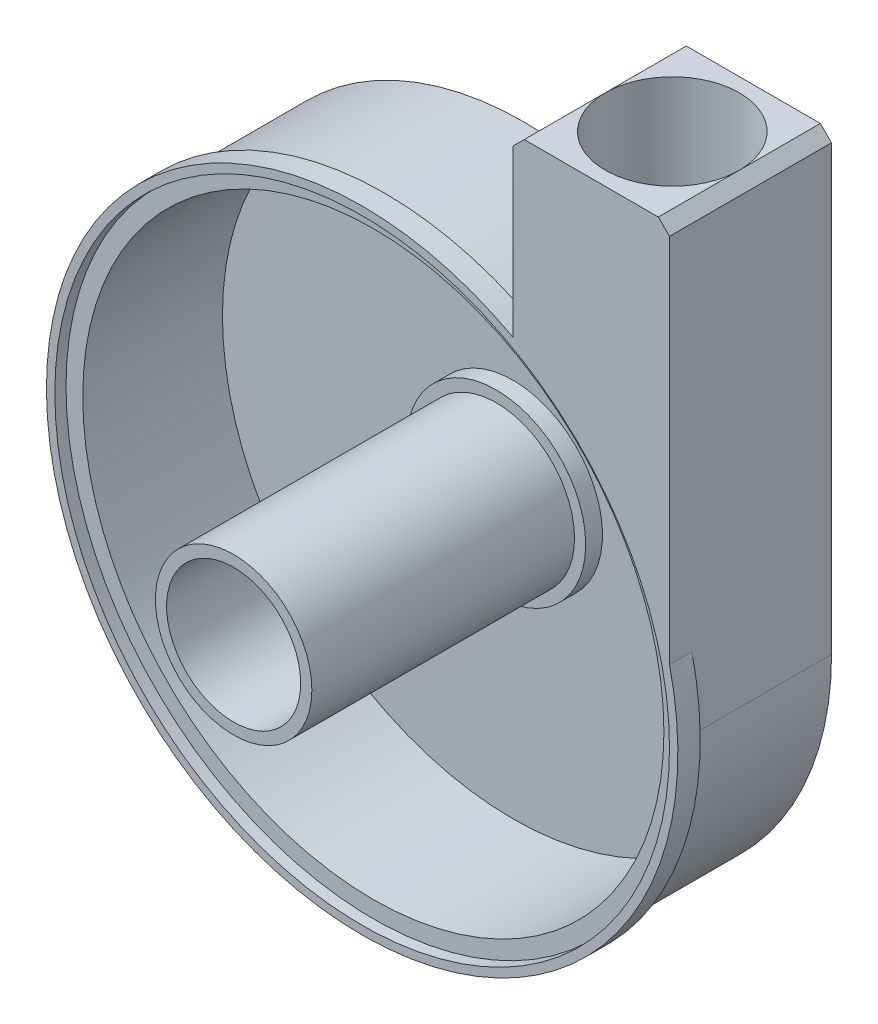
ISO-10303-21;
HEADER;
FILE_DESCRIPTION(('STEP AP214'),'2;1');
FILE_NAME('part.step','',(''),(''),'','','');
FILE_SCHEMA(('AUTOMOTIVE_DESIGN { 1 0 10303 214 1 1 1 1 }'));
ENDSEC;
DATA;
#1=APPLICATION_CONTEXT('core data for automotive mechanical design processes');
#2=APPLICATION_PROTOCOL_DEFINITION('international standard','automotive_design',2000,#1);
#3=PRODUCT_CONTEXT('',#1,'mechanical');
#4=PRODUCT('Part','Part','',(#3));
#5=PRODUCT_RELATED_PRODUCT_CATEGORY('part','',(#4));
#6=PRODUCT_DEFINITION_FORMATION('','',#4);
#7=PRODUCT_DEFINITION_CONTEXT('part definition',#1,'design');
#8=PRODUCT_DEFINITION('design','',#6,#7);
#9=PRODUCT_DEFINITION_SHAPE('','',#8);
#10=(LENGTH_UNIT() NAMED_UNIT(*) SI_UNIT(.MILLI.,.METRE.));
#11=(NAMED_UNIT(*) PLANE_ANGLE_UNIT() SI_UNIT($,.RADIAN.));
#12=(NAMED_UNIT(*) SI_UNIT($,.STERADIAN.) SOLID_ANGLE_UNIT());
#13=UNCERTAINTY_MEASURE_WITH_UNIT(LENGTH_MEASURE(1.E-05),#10,'distance_accuracy_value','');
#14=(GEOMETRIC_REPRESENTATION_CONTEXT(3) GLOBAL_UNCERTAINTY_ASSIGNED_CONTEXT((#13)) GLOBAL_UNIT_ASSIGNED_CONTEXT((#10,
#11,#12)) REPRESENTATION_CONTEXT('',''));
#15=CARTESIAN_POINT('',(0.,0.,0.));
#16=DIRECTION('',(0.,0.,1.));
#17=DIRECTION('',(1.,0.,0.));
#18=AXIS2_PLACEMENT_3D('',#15,#16,#17);
#19=CARTESIAN_POINT('',(0.,0.,25.));
#20=DIRECTION('',(0.,0.,-1.));
#21=DIRECTION('',(-1.,0.,0.));
#22=AXIS2_PLACEMENT_3D('',#19,#20,#21);
#23=CYLINDRICAL_SURFACE('',#22,55.);
#24=CARTESIAN_POINT('',(0.,0.,23.));
#25=DIRECTION('',(0.,0.,1.));
#26=DIRECTION('',(1.,0.,0.));
#27=AXIS2_PLACEMENT_3D('',#24,#25,#26);
#28=CIRCLE('',#27,55.);
#29=CARTESIAN_POINT('',(27.,47.9165942028438,23.));
#30=VERTEX_POINT('',#29);
#31=CARTESIAN_POINT('',(55.,0.,23.));
#32=VERTEX_POINT('',#31);
#33=EDGE_CURVE('E151',#30,#32,#28,.T.);
#34=ORIENTED_EDGE('',*,*,#33,.F.);
#35=DIRECTION('',(0.,0.,-1.));
#36=VECTOR('',#35,1.);
#37=CARTESIAN_POINT('',(27.,47.9165942028438,25.));
#38=LINE('',#37,#36);
#39=CARTESIAN_POINT('',(27.,47.9165942028438,-2.));
#40=VERTEX_POINT('',#39);
#41=EDGE_CURVE('E289',#30,#40,#38,.T.);
#42=ORIENTED_EDGE('',*,*,#41,.T.);
#43=CARTESIAN_POINT('',(0.,0.,-2.));
#44=DIRECTION('',(0.,0.,-1.));
#45=DIRECTION('',(-1.,0.,0.));
#46=AXIS2_PLACEMENT_3D('',#43,#44,#45);
#47=CIRCLE('',#46,55.);
#48=CARTESIAN_POINT('',(55.,0.,-2.));
#49=VERTEX_POINT('',#48);
#50=EDGE_CURVE('E246',#49,#40,#47,.T.);
#51=ORIENTED_EDGE('',*,*,#50,.F.);
#52=DIRECTION('',(0.,0.,-1.));
#53=VECTOR('',#52,1.);
#54=CARTESIAN_POINT('',(55.,0.,25.));
#55=LINE('',#54,#53);
#56=EDGE_CURVE('E292',#32,#49,#55,.T.);
#57=ORIENTED_EDGE('',*,*,#56,.F.);
#58=EDGE_LOOP('',(#34,#42,#51,#57));
#59=FACE_BOUND('',#58,.T.);
#60=ADVANCED_FACE('F41',(#59),#23,.T.);
#61=CARTESIAN_POINT('',(55.,0.,-2.));
#62=DIRECTION('',(1.,0.,0.));
#63=DIRECTION('',(0.,0.,-1.));
#64=AXIS2_PLACEMENT_3D('',#61,#62,#63);
#65=PLANE('',#64);
#66=DIRECTION('',(0.,0.,-1.));
#67=VECTOR('',#66,1.);
#68=CARTESIAN_POINT('',(55.,12.9325171563776,27.));
#69=LINE('',#68,#67);
#70=CARTESIAN_POINT('',(55.,12.9325171563775,27.));
#71=VERTEX_POINT('',#70);
#72=CARTESIAN_POINT('',(55.,12.9325171563776,23.));
#73=VERTEX_POINT('',#72);
#74=EDGE_CURVE('E63',#71,#73,#69,.T.);
#75=ORIENTED_EDGE('',*,*,#74,.T.);
#76=DIRECTION('',(0.,-1.,0.));
#77=VECTOR('',#76,1.);
#78=CARTESIAN_POINT('',(55.,0.,23.));
#79=LINE('',#78,#77);
#80=EDGE_CURVE('E67',#73,#32,#79,.T.);
#81=ORIENTED_EDGE('',*,*,#80,.T.);
#82=ORIENTED_EDGE('',*,*,#56,.T.);
#83=DIRECTION('',(0.,1.,0.));
#84=VECTOR('',#83,1.);
#85=CARTESIAN_POINT('',(55.,0.,-2.));
#86=LINE('',#85,#84);
#87=CARTESIAN_POINT('',(55.,79.287132565223,-2.));
#88=VERTEX_POINT('',#87);
#89=EDGE_CURVE('E251',#49,#88,#86,.T.);
#90=ORIENTED_EDGE('',*,*,#89,.T.);
#91=DIRECTION('',(0.,0.,1.));
#92=VECTOR('',#91,1.);
#93=CARTESIAN_POINT('',(55.,79.287132565223,-2.));
#94=LINE('',#93,#92);
#95=CARTESIAN_POINT('',(55.,79.287132565223,27.));
#96=VERTEX_POINT('',#95);
#97=EDGE_CURVE('E143',#88,#96,#94,.T.);
#98=ORIENTED_EDGE('',*,*,#97,.T.);
#99=DIRECTION('',(0.,1.,0.));
#100=VECTOR('',#99,1.);
#101=CARTESIAN_POINT('',(55.,0.,27.));
#102=LINE('',#101,#100);
#103=EDGE_CURVE('E250',#71,#96,#102,.T.);
#104=ORIENTED_EDGE('',*,*,#103,.F.);
#105=EDGE_LOOP('',(#75,#81,#82,#90,#98,#104));
#106=FACE_BOUND('',#105,.T.);
#107=ADVANCED_FACE('F193',(#106),#65,.T.);
#108=CARTESIAN_POINT('',(27.,0.,-2.));
#109=DIRECTION('',(-1.,0.,0.));
#110=DIRECTION('',(0.,0.,1.));
#111=AXIS2_PLACEMENT_3D('',#108,#109,#110);
#112=PLANE('',#111);
#113=ORIENTED_EDGE('',*,*,#41,.F.);
#114=DIRECTION('',(0.,1.,0.));
#115=VECTOR('',#114,1.);
#116=CARTESIAN_POINT('',(27.,0.,23.));
#117=LINE('',#116,#115);
#118=CARTESIAN_POINT('',(27.,49.6311394187157,23.));
#119=VERTEX_POINT('',#118);
#120=EDGE_CURVE('E384',#30,#119,#117,.T.);
#121=ORIENTED_EDGE('',*,*,#120,.T.);
#122=DIRECTION('',(0.,0.,-1.));
#123=VECTOR('',#122,1.);
#124=CARTESIAN_POINT('',(27.,49.6311394187157,27.));
#125=LINE('',#124,#123);
#126=CARTESIAN_POINT('',(27.,49.6311394187157,27.));
#127=VERTEX_POINT('',#126);
#128=EDGE_CURVE('E368',#119,#127,#125,.F.);
#129=ORIENTED_EDGE('',*,*,#128,.T.);
#130=DIRECTION('',(0.,-1.,0.));
#131=VECTOR('',#130,1.);
#132=CARTESIAN_POINT('',(27.,0.,27.));
#133=LINE('',#132,#131);
#134=CARTESIAN_POINT('',(27.,79.287132565223,27.));
#135=VERTEX_POINT('',#134);
#136=EDGE_CURVE('E271',#135,#127,#133,.T.);
#137=ORIENTED_EDGE('',*,*,#136,.F.);
#138=DIRECTION('',(0.,0.,-1.));
#139=VECTOR('',#138,1.);
#140=CARTESIAN_POINT('',(27.,79.287132565223,-2.));
#141=LINE('',#140,#139);
#142=CARTESIAN_POINT('',(27.,79.287132565223,-2.));
#143=VERTEX_POINT('',#142);
#144=EDGE_CURVE('E322',#135,#143,#141,.T.);
#145=ORIENTED_EDGE('',*,*,#144,.T.);
#146=DIRECTION('',(0.,-1.,0.));
#147=VECTOR('',#146,1.);
#148=CARTESIAN_POINT('',(27.,0.,-2.));
#149=LINE('',#148,#147);
#150=EDGE_CURVE('E260',#143,#40,#149,.T.);
#151=ORIENTED_EDGE('',*,*,#150,.T.);
#152=EDGE_LOOP('',(#113,#121,#129,#137,#145,#151));
#153=FACE_BOUND('',#152,.T.);
#154=ADVANCED_FACE('F199',(#153),#112,.T.);
#155=CARTESIAN_POINT('',(41.,1.28713256522298,12.5));
#156=DIRECTION('',(0.,1.,0.));
#157=DIRECTION('',(0.,0.,1.));
#158=AXIS2_PLACEMENT_3D('',#155,#156,#157);
#159=CYLINDRICAL_SURFACE('',#158,12.);
#160=CARTESIAN_POINT('',(41.,81.287132565223,12.5));
#161=DIRECTION('',(0.,1.,0.));
#162=DIRECTION('',(0.,0.,1.));
#163=AXIS2_PLACEMENT_3D('',#160,#161,#162);
#164=CIRCLE('',#163,12.);
#165=CARTESIAN_POINT('',(53.,81.287132565223,12.5));
#166=VERTEX_POINT('',#165);
#167=CARTESIAN_POINT('',(29.,81.287132565223,12.5));
#168=VERTEX_POINT('',#167);
#169=EDGE_CURVE('E225',#166,#168,#164,.T.);
#170=ORIENTED_EDGE('',*,*,#169,.T.);
#171=EDGE_CURVE('E352',#168,#166,#164,.T.);
#172=ORIENTED_EDGE('',*,*,#171,.T.);
#173=EDGE_LOOP('',(#170,#172));
#174=FACE_BOUND('',#173,.T.);
#175=CARTESIAN_POINT('',(51.9840676530756,1.28713256522298,17.3322104458165));
#176=CARTESIAN_POINT('',(51.9745694362723,1.67110930174672,17.3537119873882));
#177=CARTESIAN_POINT('',(51.9608151287572,2.05433764750318,17.3848977053577));
#178=CARTESIAN_POINT('',(51.9249724935482,2.81835467896894,17.4645845076469));
#179=CARTESIAN_POINT('',(51.9028897243842,3.19914481996402,17.5130740420023));
#180=CARTESIAN_POINT('',(51.8506464669257,3.95653326228744,17.6251537999123));
#181=CARTESIAN_POINT('',(51.8205144132512,4.33314155030208,17.6886907794489));
#182=CARTESIAN_POINT('',(51.7523140485848,5.08329112968576,17.8285841618358));
#183=CARTESIAN_POINT('',(51.7142443029309,5.45683185391914,17.9049428816067));
#184=CARTESIAN_POINT('',(51.6302235136286,6.20168317940109,18.0683744650405));
#185=CARTESIAN_POINT('',(51.5842521441956,6.57298540730616,18.1554747925049));
#186=CARTESIAN_POINT('',(51.4846334750242,7.31243202309994,18.338091180765));
#187=CARTESIAN_POINT('',(51.4309866065403,7.68057658717377,18.4336067686261));
#188=CARTESIAN_POINT('',(51.258549628427,8.78143244711176,18.7301082909783));
#189=CARTESIAN_POINT('',(51.1283562135597,9.50974566418177,18.9408601325688));
#190=CARTESIAN_POINT('',(50.8350356067977,10.9711469744673,19.3806646733147));
#191=CARTESIAN_POINT('',(50.671279176739,11.7040187841901,19.6100070385101));
#192=CARTESIAN_POINT('',(50.3126296030789,13.160618103055,20.0736984698944));
#193=CARTESIAN_POINT('',(50.1177319900366,13.8843442834858,20.3080482505683));
#194=CARTESIAN_POINT('',(49.6965462062547,15.3237002972135,20.7745974405658));
#195=CARTESIAN_POINT('',(49.4702438663132,16.0393263173573,21.0067958284924));
#196=CARTESIAN_POINT('',(48.9859965672613,17.4624455715886,21.4629537643854));
#197=CARTESIAN_POINT('',(48.7280528880916,18.1699391333809,21.6869136451359));
#198=CARTESIAN_POINT('',(48.1810434403361,19.5742929508029,22.1205010589176));
#199=CARTESIAN_POINT('',(47.8920862101765,20.2711811352199,22.3301746322135));
#200=CARTESIAN_POINT('',(47.2819013814071,21.6562810573743,22.7308834392291));
#201=CARTESIAN_POINT('',(46.9606705395514,22.3444919152711,22.9219167959425));
#202=CARTESIAN_POINT('',(46.2860583091104,23.7103401868625,23.2797597972987));
#203=CARTESIAN_POINT('',(45.9327169931327,24.3879895758711,23.4465989779784));
#204=CARTESIAN_POINT('',(45.193510841899,25.7319725222956,23.7505171752589));
#205=CARTESIAN_POINT('',(44.8076564821327,26.3983096419459,23.8876057268042));
#206=CARTESIAN_POINT('',(44.0861203372295,27.5824420196436,24.1011580168158));
#207=CARTESIAN_POINT('',(43.7563894298821,28.1026616172599,24.1842895376967));
#208=CARTESIAN_POINT('',(43.0769070475607,29.1335037232319,24.323990815637));
#209=CARTESIAN_POINT('',(42.727157810391,29.6441272958616,24.3805635351645));
#210=CARTESIAN_POINT('',(42.0077324536583,30.6551129392115,24.463101779875));
#211=CARTESIAN_POINT('',(41.6380226238782,31.155455546945,24.4890137186237));
#212=CARTESIAN_POINT('',(40.8805112396724,32.1429770482467,24.5053840158863));
#213=CARTESIAN_POINT('',(40.4927094695928,32.6301557847937,24.4958419516859));
#214=CARTESIAN_POINT('',(39.6959357874045,33.5950753084102,24.4357066912785));
#215=CARTESIAN_POINT('',(39.2867551156926,34.0726128821382,24.3845847961161));
#216=CARTESIAN_POINT('',(38.4550479032361,35.0085861759452,24.2346395446702));
#217=CARTESIAN_POINT('',(38.0325187958329,35.4670181825883,24.1358069616823));
#218=CARTESIAN_POINT('',(37.1803746320696,36.3593047535247,23.8845141990669));
#219=CARTESIAN_POINT('',(36.7507876229339,36.7932355668633,23.7322324088935));
#220=CARTESIAN_POINT('',(35.8900273320619,37.6333188602382,23.3676693054707));
#221=CARTESIAN_POINT('',(35.4588555725789,38.0394930262137,23.1554355132812));
#222=CARTESIAN_POINT('',(34.777624459092,38.6605148945844,22.7648781818436));
#223=CARTESIAN_POINT('',(34.5250816993346,38.8861090077131,22.6077508630353));
#224=CARTESIAN_POINT('',(34.0250418051374,39.3243798518123,22.2693923494689));
#225=CARTESIAN_POINT('',(33.7775430949317,39.5370606593171,22.0881688197543));
#226=CARTESIAN_POINT('',(33.2902082385774,39.9482633390739,21.7008692014771));
#227=CARTESIAN_POINT('',(33.0503731905696,40.146783187153,21.4947895712578));
#228=CARTESIAN_POINT('',(32.5814220684351,40.5282901074064,21.0574716380064));
#229=CARTESIAN_POINT('',(32.3523063950423,40.7112765990884,20.8262323954787));
#230=CARTESIAN_POINT('',(31.9060058800817,41.0620033343906,20.3364569261454));
#231=CARTESIAN_POINT('',(31.6889549199548,41.2295823841218,20.0776824430867));
#232=CARTESIAN_POINT('',(31.2727570831849,41.5461557378602,19.5354483011476));
#233=CARTESIAN_POINT('',(31.073610688046,41.6951495420998,19.251987978799));
#234=CARTESIAN_POINT('',(30.6970270713713,41.973173679815,18.6620703843875));
#235=CARTESIAN_POINT('',(30.5195750477024,42.1022176412103,18.35562902529));
#236=CARTESIAN_POINT('',(30.1898093904112,42.3393043794996,17.7218115195374));
#237=CARTESIAN_POINT('',(30.037490886441,42.447351225916,17.3944394459143));
#238=CARTESIAN_POINT('',(29.7806511487351,42.6278533970847,16.7689531854471));
#239=CARTESIAN_POINT('',(29.6724219194563,42.7031757107383,16.473181731895));
#240=CARTESIAN_POINT('',(29.4787494608739,42.8371009098809,15.8705932317058));
#241=CARTESIAN_POINT('',(29.3933041251962,42.8957053409755,15.5637772091193));
#242=CARTESIAN_POINT('',(29.24672411282,42.9957790345472,14.9418307770493));
#243=CARTESIAN_POINT('',(29.1855764806886,43.037257429017,14.6267048941917));
#244=CARTESIAN_POINT('',(29.0886221287975,43.1028480761907,13.9908009292574));
#245=CARTESIAN_POINT('',(29.0528133320548,43.1269617522551,13.6700233126537));
#246=CARTESIAN_POINT('',(29.0096992662453,43.1559719483977,13.0614389968831));
#247=CARTESIAN_POINT('',(28.9996809194966,43.1626979836285,12.7739070247221));
#248=CARTESIAN_POINT('',(29.0003344928752,43.162259080735,12.1988937628445));
#249=CARTESIAN_POINT('',(29.0110044897182,43.15509543386,11.9114124709011));
#250=CARTESIAN_POINT('',(29.0528733303176,43.1269194504915,11.3387146800553));
#251=CARTESIAN_POINT('',(29.0840667359642,43.105910782526,11.0534976014575));
#252=CARTESIAN_POINT('',(29.1665290557954,43.0501574304146,10.487340685991));
#253=CARTESIAN_POINT('',(29.2177981754666,43.0154126056713,10.2064008929334));
#254=CARTESIAN_POINT('',(29.3383142891486,42.9333028960607,9.65704601685333));
#255=CARTESIAN_POINT('',(29.4071316559976,42.8862389717612,9.38849134928419));
#256=CARTESIAN_POINT('',(29.5623404178681,42.7793980324254,8.85911770797881));
#257=CARTESIAN_POINT('',(29.6487313283606,42.7196213678964,8.59829852119085));
#258=CARTESIAN_POINT('',(29.8379797252684,42.5876538671114,8.08594409794056));
#259=CARTESIAN_POINT('',(29.9408376859299,42.5154626733163,7.83440912911772));
#260=CARTESIAN_POINT('',(30.1617453172764,42.3590300576804,7.34199026473146));
#261=CARTESIAN_POINT('',(30.2797955206138,42.2747882133224,7.10110674301436));
#262=CARTESIAN_POINT('',(30.5355905849295,42.0904230083639,6.62005060334006));
#263=CARTESIAN_POINT('',(30.6740019723469,41.9897377772978,6.38044801330008));
#264=CARTESIAN_POINT('',(30.9642532601789,41.776159173028,5.9152475970459));
#265=CARTESIAN_POINT('',(31.1160934604224,41.6632655272313,5.68965008371826));
#266=CARTESIAN_POINT('',(31.4314865700803,41.4258446637232,5.25320378581339));
#267=CARTESIAN_POINT('',(31.5950414840092,41.3013154539254,5.04235753759732));
#268=CARTESIAN_POINT('',(31.9321188625636,41.0412610075159,4.63595211361611));
#269=CARTESIAN_POINT('',(32.1056426093364,40.905734355533,4.44039491193123));
#270=CARTESIAN_POINT('',(32.481722253498,40.6079025024139,4.04291509639092));
#271=CARTESIAN_POINT('',(32.6853013746002,40.4443186571349,3.84291847677442));
#272=CARTESIAN_POINT('',(33.1005295307535,40.1051968727267,3.46242920752293));
#273=CARTESIAN_POINT('',(33.3121789645621,39.9296583425736,3.28193752332879));
#274=CARTESIAN_POINT('',(33.7415498097628,39.5674954270473,2.94017717249196));
#275=CARTESIAN_POINT('',(33.959273061053,39.3808676627147,2.77891441049507));
#276=CARTESIAN_POINT('',(34.3988833727023,38.9974612874152,2.47519730544743));
#277=CARTESIAN_POINT('',(34.6207712399729,38.8006806961051,2.33274665119673));
#278=CARTESIAN_POINT('',(35.1886685806181,38.2880258451458,1.99334976986854));
#279=CARTESIAN_POINT('',(35.5364295098228,37.9656850348828,1.80900508218152));
#280=CARTESIAN_POINT('',(36.2327335293313,37.3017530570086,1.48085960697622));
#281=CARTESIAN_POINT('',(36.5812768905149,36.960153716369,1.33707619083614));
#282=CARTESIAN_POINT('',(37.2757269566632,36.2596727212093,1.08657303683363));
#283=CARTESIAN_POINT('',(37.6216267619205,35.900756957167,0.979930159660575));
#284=CARTESIAN_POINT('',(38.306899596174,35.1686378980617,0.800741516364733));
#285=CARTESIAN_POINT('',(38.6462726266834,34.7954346063114,0.728195742336321));
#286=CARTESIAN_POINT('',(39.4773170170129,33.8541357709139,0.586361130990221));
#287=CARTESIAN_POINT('',(39.9637532684799,33.2786162255362,0.535411785151946));
#288=CARTESIAN_POINT('',(40.912124078594,32.1055750149096,0.490928745097687));
#289=CARTESIAN_POINT('',(41.3740465614912,31.5080427470373,0.497423088943499));
#290=CARTESIAN_POINT('',(42.270598436407,30.294654311332,0.558994411464451));
#291=CARTESIAN_POINT('',(42.7052038953758,29.6787827533987,0.614113372784211));
#292=CARTESIAN_POINT('',(43.5449901838663,28.4323523351908,0.765220881085495));
#293=CARTESIAN_POINT('',(43.9501720840304,27.8017940104311,0.861207940116096));
#294=CARTESIAN_POINT('',(44.6572216467141,26.6477174168124,1.06612073493955));
#295=CARTESIAN_POINT('',(44.9642217774066,26.1262819616131,1.16925168880449));
#296=CARTESIAN_POINT('',(45.5581979866705,25.0761742300501,1.39487611131003));
#297=CARTESIAN_POINT('',(45.8451714332686,24.547501013356,1.51737211808825));
#298=CARTESIAN_POINT('',(46.3991499005108,23.4835845639411,1.77885216410611));
#299=CARTESIAN_POINT('',(46.6661478004427,22.9483390667942,1.91784203770852));
#300=CARTESIAN_POINT('',(47.1801897667621,21.8720237745661,2.20958537879276));
#301=CARTESIAN_POINT('',(47.4272312442413,21.3309532340984,2.36234062660961));
#302=CARTESIAN_POINT('',(48.1396252067601,19.6974624425611,2.83811017273712));
#303=CARTESIAN_POINT('',(48.5751894289141,18.5967999640165,3.17810902095779));
#304=CARTESIAN_POINT('',(49.1699373155457,16.9311823264762,3.70667375873392));
#305=CARTESIAN_POINT('',(49.3584490537078,16.3734367204529,3.88599059696032));
#306=CARTESIAN_POINT('',(49.7161549799081,15.2528630249043,4.24812973127111));
#307=CARTESIAN_POINT('',(49.8853491983607,14.6900349433824,4.43095202183581));
#308=CARTESIAN_POINT('',(50.1899245284262,13.6108922240388,4.78028703506113));
#309=CARTESIAN_POINT('',(50.3269831243474,13.0950361547734,4.94676071725658));
#310=CARTESIAN_POINT('',(50.5853110901754,12.0586688677977,5.27741011643913));
#311=CARTESIAN_POINT('',(50.7065810913529,11.5381578370952,5.44158592506703));
#312=CARTESIAN_POINT('',(50.9331737617893,10.4927348802008,5.76421132804177));
#313=CARTESIAN_POINT('',(51.0385185065306,9.96783013055009,5.92266861288596));
#314=CARTESIAN_POINT('',(51.233388794606,8.91223811625418,6.23016148706712));
#315=CARTESIAN_POINT('',(51.3229119673848,8.38154999770837,6.37919566238941));
#316=CARTESIAN_POINT('',(51.4857110571973,7.31517047978924,6.66249308607005));
#317=CARTESIAN_POINT('',(51.5590270237624,6.77949490101472,6.79679232221448));
#318=CARTESIAN_POINT('',(51.6893187327968,5.70165482986253,7.04490123541474));
#319=CARTESIAN_POINT('',(51.7463022895639,5.15949357036743,7.15872070135187));
#320=CARTESIAN_POINT('',(51.8437296495413,4.0657591629753,7.35936524885506));
#321=CARTESIAN_POINT('',(51.8840905939043,3.51415280761044,7.44605459208245));
#322=CARTESIAN_POINT('',(51.931519401488,2.68228407823274,7.54991585865316));
#323=CARTESIAN_POINT('',(51.9451498512646,2.40400136179442,7.580189427998));
#324=CARTESIAN_POINT('',(51.9679618670431,1.84631780843159,7.63126957422093));
#325=CARTESIAN_POINT('',(51.9771422797442,1.56691670055392,7.65207369685006));
#326=CARTESIAN_POINT('',(51.9840676530756,1.28713256522295,7.66778955418346));
#327=B_SPLINE_CURVE_WITH_KNOTS('',3,(#175,#176,#177,#178,#179,#180,#181,#182,#183,#184,#185,
#186,#187,#188,#189,#190,#191,#192,#193,#194,#195,#196,#197,#198,#199,#200,#201,#202,#203,#204,
#205,#206,#207,#208,#209,#210,#211,#212,#213,#214,#215,#216,#217,#218,#219,#220,#221,#222,#223,
#224,#225,#226,#227,#228,#229,#230,#231,#232,#233,#234,#235,#236,#237,#238,#239,#240,#241,#242,
#243,#244,#245,#246,#247,#248,#249,#250,#251,#252,#253,#254,#255,#256,#257,#258,#259,#260,#261,
#262,#263,#264,#265,#266,#267,#268,#269,#270,#271,#272,#273,#274,#275,#276,#277,#278,#279,#280,
#281,#282,#283,#284,#285,#286,#287,#288,#289,#290,#291,#292,#293,#294,#295,#296,#297,#298,#299,
#300,#301,#302,#303,#304,#305,#306,#307,#308,#309,#310,#311,#312,#313,#314,#315,#316,#317,#318,
#319,#320,#321,#322,#323,#324,#325,#326),.UNSPECIFIED.,.F.,.F.,(4,2,2,2,2,2,2,2,2,2,2,2,2,2,2,2,
2,2,2,2,2,2,2,2,2,2,2,2,2,2,2,2,2,2,2,2,2,2,2,2,2,2,2,2,2,2,2,2,2,2,2,2,2,2,2,2,2,2,2,2,2,2,2,2,
2,2,2,2,2,2,2,2,2,2,2,4),(0.,1.15379575700456,2.30682281364456,3.45582939023745,
4.60504381908351,5.75725993122157,6.90941133050631,9.21625094652474,11.5711183075296,
13.9263239475979,16.2825956865218,18.6387721420637,20.9869561255545,23.3353763196785,
25.6809050022991,28.0256808395761,29.8893280710699,31.7527673749615,33.6194586596002,
35.4861722006714,37.3769996161224,39.2681928426696,41.1531332124871,43.036583653422,
44.1556252168191,45.2743116591261,46.3931576877737,47.5120455100698,48.6415532043629,
49.7710912652076,50.8998542860298,52.0283983187804,52.9985428638346,53.9685976877765,
54.9381345863033,55.9075920042631,56.7698927240105,57.6321132841334,58.494105472701,
59.3561064844892,60.1987477477379,61.0413657812477,61.8840080862704,62.7266799430605,
63.6091195619275,64.4915788882344,65.3741895752944,66.2569140350928,67.2427774373099,
68.2286896147354,69.2149037618566,70.201311006007,71.7252144667741,73.249769589868,
74.7774612216414,76.3051524992101,78.5674257041853,80.8308031776213,83.0961367728614,
85.3613878974899,87.2021713725238,89.0431963155952,90.8848744351241,92.7267910896032,
96.4176654238183,98.2637718556041,100.109875380743,101.786981658519,103.464020860449,
105.138713614317,106.813657076025,108.484414142514,110.154370489978,111.832553168194,
112.673143762404,113.513952093257),.UNSPECIFIED.);
#328=CARTESIAN_POINT('',(51.9840676530756,1.28713256522298,17.3322104458165));
#329=VERTEX_POINT('',#328);
#330=CARTESIAN_POINT('',(51.9840676530756,1.28713256522298,7.66778955418354));
#331=VERTEX_POINT('',#330);
#332=EDGE_CURVE('E214',#329,#331,#327,.T.);
#333=ORIENTED_EDGE('',*,*,#332,.T.);
#334=CARTESIAN_POINT('',(41.,1.28713256522298,12.5));
#335=DIRECTION('',(0.,1.,0.));
#336=DIRECTION('',(0.,0.,1.));
#337=AXIS2_PLACEMENT_3D('',#334,#335,#336);
#338=CIRCLE('',#337,12.);
#339=EDGE_CURVE('E224',#329,#331,#338,.T.);
#340=ORIENTED_EDGE('',*,*,#339,.F.);
#341=EDGE_LOOP('',(#333,#340));
#342=FACE_BOUND('',#341,.T.);
#343=CARTESIAN_POINT('',(35.1905249806889,44.2026803665062,23.));
#344=CARTESIAN_POINT('',(35.3749365302978,44.0558718777332,23.1020291789073));
#345=CARTESIAN_POINT('',(35.560336704442,43.9063806029458,23.1982653801743));
#346=CARTESIAN_POINT('',(35.9324438034901,43.6023751605868,23.3794624553174));
#347=CARTESIAN_POINT('',(36.1191504018676,43.447862215248,23.4644260476422));
#348=CARTESIAN_POINT('',(36.6796378512589,42.9778011308828,23.7026366890299));
#349=CARTESIAN_POINT('',(37.0545020537072,42.6551624282525,23.8395942502742));
#350=CARTESIAN_POINT('',(37.7992236788738,41.9965933639329,24.0717735358047));
#351=CARTESIAN_POINT('',(38.169096501691,41.6608002899795,24.1673422117704));
#352=CARTESIAN_POINT('',(38.9039845558947,40.9753913968028,24.321494920532));
#353=CARTESIAN_POINT('',(39.2689969580493,40.6257679600328,24.3800582612929));
#354=CARTESIAN_POINT('',(40.1102279563304,39.7978991699142,24.4767199443748));
#355=CARTESIAN_POINT('',(40.5835440928577,39.3151650610222,24.501755504056));
#356=CARTESIAN_POINT('',(41.512383448029,38.333136153184,24.4980527859937));
#357=CARTESIAN_POINT('',(41.9679018297845,37.8338369195816,24.469299992567));
#358=CARTESIAN_POINT('',(42.8600563247876,36.8201483930502,24.3635063026948));
#359=CARTESIAN_POINT('',(43.2966086272819,36.3057062407722,24.2862705965261));
#360=CARTESIAN_POINT('',(44.1469087686127,35.2668532037017,24.0882479733671));
#361=CARTESIAN_POINT('',(44.5606638287769,34.7424455472296,23.9674749399));
#362=CARTESIAN_POINT('',(45.2869253161634,33.7880370757974,23.7134002404121));
#363=CARTESIAN_POINT('',(45.603573602611,33.3593256746008,23.5870022748337));
#364=CARTESIAN_POINT('',(46.0657403760265,32.7149340604739,23.3796393770751));
#365=CARTESIAN_POINT('',(46.2172312138324,32.5005537847174,23.3077965024308));
#366=CARTESIAN_POINT('',(46.5162994514096,32.0710521296757,23.1582538900542));
#367=CARTESIAN_POINT('',(46.6638762269741,31.8559306382907,23.0805532256357));
#368=CARTESIAN_POINT('',(46.8094750193111,31.6405285735951,23.));
#369=B_SPLINE_CURVE_WITH_KNOTS('',3,(#343,#344,#345,#346,#347,#348,#349,#350,#351,#352,#353,
#354,#355,#356,#357,#358,#359,#360,#361,#362,#363,#364,#365,#366,#367,#368),.UNSPECIFIED.,.F.,
.F.,(4,2,2,2,2,2,2,2,2,2,2,2,4),(0.,0.770358008527263,1.54052990220082,3.07790411375054,
4.6021290062652,6.12720543734787,8.15379529460039,10.1809321397829,12.2162668468387,
14.2509530837654,15.8933922966776,16.7097840684417,17.5263052632674),.UNSPECIFIED.);
#370=CARTESIAN_POINT('',(35.1905249806889,44.2026803665062,23.));
#371=VERTEX_POINT('',#370);
#372=CARTESIAN_POINT('',(46.8094750193111,31.6405285735951,23.));
#373=VERTEX_POINT('',#372);
#374=EDGE_CURVE('E11',#371,#373,#369,.T.);
#375=ORIENTED_EDGE('',*,*,#374,.F.);
#376=DIRECTION('',(0.,1.,0.));
#377=VECTOR('',#376,1.);
#378=CARTESIAN_POINT('',(35.1905249806889,1.28713256522298,23.));
#379=LINE('',#378,#377);
#380=CARTESIAN_POINT('',(35.1905249806889,42.2685101651751,23.));
#381=VERTEX_POINT('',#380);
#382=EDGE_CURVE('E142',#381,#371,#379,.T.);
#383=ORIENTED_EDGE('',*,*,#382,.F.);
#384=CARTESIAN_POINT('',(35.1905249806889,42.2685101651751,23.));
#385=CARTESIAN_POINT('',(35.3720320263226,42.1174019269261,23.1004218196734));
#386=CARTESIAN_POINT('',(35.5543698933934,41.9636119301321,23.1951624637413));
#387=CARTESIAN_POINT('',(35.9200577429607,41.6510171373508,23.3736188280755));
#388=CARTESIAN_POINT('',(36.1034074703682,41.4922135615407,23.4573372056238));
#389=CARTESIAN_POINT('',(36.6534310282093,41.0093100174098,23.6922335785994));
#390=CARTESIAN_POINT('',(37.0207776896055,40.6781371936885,23.8275338531066));
#391=CARTESIAN_POINT('',(37.7495092678355,40.0027416109122,24.0576416904364));
#392=CARTESIAN_POINT('',(38.1109181296667,39.6586617768138,24.1528000228898));
#393=CARTESIAN_POINT('',(38.8281855497492,38.9566950260194,24.3075351946004));
#394=CARTESIAN_POINT('',(39.1840408420561,38.5988003851725,24.3670918121911));
#395=CARTESIAN_POINT('',(40.0246951317181,37.7295347079705,24.470440739148));
#396=CARTESIAN_POINT('',(40.5057221862062,37.2126881877978,24.499053887355));
#397=CARTESIAN_POINT('',(41.4474971048215,36.1608073552185,24.5009005216486));
#398=CARTESIAN_POINT('',(41.9082385277665,35.6257673601619,24.4741165454794));
#399=CARTESIAN_POINT('',(42.8086142788952,34.5387169711465,24.3716108509279));
#400=CARTESIAN_POINT('',(43.2481409642717,33.9866394548562,24.2956630480365));
#401=CARTESIAN_POINT('',(44.1019363438388,32.8711498762706,24.1004193764203));
#402=CARTESIAN_POINT('',(44.5162127210159,32.3077413317973,23.9811367709742));
#403=CARTESIAN_POINT('',(45.2520278740081,31.2664381869349,23.7269990118165));
#404=CARTESIAN_POINT('',(45.5775367651874,30.7898928684768,23.5980263391053));
#405=CARTESIAN_POINT('',(46.0509820474135,30.0730507051721,23.38655998639));
#406=CARTESIAN_POINT('',(46.2058487895798,29.834542940252,23.3133363597143));
#407=CARTESIAN_POINT('',(46.5110602292054,29.356459602406,23.1610172062958));
#408=CARTESIAN_POINT('',(46.6614042874075,29.1168838839744,23.0819208549035));
#409=CARTESIAN_POINT('',(46.8094750193111,28.876860085828,23.));
#410=B_SPLINE_CURVE_WITH_KNOTS('',3,(#384,#385,#386,#387,#388,#389,#390,#391,#392,#393,#394,
#395,#396,#397,#398,#399,#400,#401,#402,#403,#404,#405,#406,#407,#408,#409),.UNSPECIFIED.,.F.,
.F.,(4,2,2,2,2,2,2,2,2,2,2,2,4),(0.,0.769737502877347,1.53928909393066,3.07544989508894,
4.59789442543441,6.12120288002892,8.2379285340513,10.3553215230423,12.4825213869845,
14.6090707366373,16.3822088854677,17.2630809121696,18.1440768659252),.UNSPECIFIED.);
#411=CARTESIAN_POINT('',(46.8094750193111,28.876860085828,23.));
#412=VERTEX_POINT('',#411);
#413=EDGE_CURVE('E133',#381,#412,#410,.T.);
#414=ORIENTED_EDGE('',*,*,#413,.T.);
#415=DIRECTION('',(0.,1.,0.));
#416=VECTOR('',#415,1.);
#417=CARTESIAN_POINT('',(46.8094750193111,1.28713256522298,23.));
#418=LINE('',#417,#416);
#419=EDGE_CURVE('E56',#373,#412,#418,.F.);
#420=ORIENTED_EDGE('',*,*,#419,.F.);
#421=EDGE_LOOP('',(#375,#383,#414,#420));
#422=FACE_BOUND('',#421,.T.);
#423=ADVANCED_FACE('F154',(#174,#342,#422),#159,.F.);
#424=CARTESIAN_POINT('',(0.,81.287132565223,-2.));
#425=DIRECTION('',(0.,1.,0.));
#426=DIRECTION('',(0.,0.,1.));
#427=AXIS2_PLACEMENT_3D('',#424,#425,#426);
#428=PLANE('',#427);
#429=DIRECTION('',(-1.,0.,0.));
#430=VECTOR('',#429,1.);
#431=CARTESIAN_POINT('',(0.,81.287132565223,-2.));
#432=LINE('',#431,#430);
#433=CARTESIAN_POINT('',(53.,81.287132565223,-2.));
#434=VERTEX_POINT('',#433);
#435=CARTESIAN_POINT('',(29.,81.287132565223,-2.));
#436=VERTEX_POINT('',#435);
#437=EDGE_CURVE('E255',#434,#436,#432,.T.);
#438=ORIENTED_EDGE('',*,*,#437,.T.);
#439=DIRECTION('',(0.,0.,1.));
#440=VECTOR('',#439,1.);
#441=CARTESIAN_POINT('',(29.,81.287132565223,-2.));
#442=LINE('',#441,#440);
#443=EDGE_CURVE('E312',#436,#168,#442,.T.);
#444=ORIENTED_EDGE('',*,*,#443,.T.);
#445=ORIENTED_EDGE('',*,*,#169,.F.);
#446=DIRECTION('',(0.,0.,-1.));
#447=VECTOR('',#446,1.);
#448=CARTESIAN_POINT('',(53.,81.287132565223,-2.));
#449=LINE('',#448,#447);
#450=EDGE_CURVE('E303',#166,#434,#449,.T.);
#451=ORIENTED_EDGE('',*,*,#450,.T.);
#452=EDGE_LOOP('',(#438,#444,#445,#451));
#453=FACE_BOUND('',#452,.T.);
#454=ADVANCED_FACE('F358',(#453),#428,.T.);
#455=CARTESIAN_POINT('',(0.,0.,0.));
#456=DIRECTION('',(0.,0.,-1.));
#457=DIRECTION('',(-1.,0.,0.));
#458=AXIS2_PLACEMENT_3D('',#455,#456,#457);
#459=PLANE('',#458);
#460=CARTESIAN_POINT('',(0.,0.,0.));
#461=DIRECTION('',(0.,0.,1.));
#462=DIRECTION('',(1.,0.,0.));
#463=AXIS2_PLACEMENT_3D('',#460,#461,#462);
#464=CIRCLE('',#463,52.);
#465=CARTESIAN_POINT('',(52.,0.,0.));
#466=VERTEX_POINT('',#465);
#467=EDGE_CURVE('E264',#466,#466,#464,.T.);
#468=ORIENTED_EDGE('',*,*,#467,.T.);
#469=EDGE_LOOP('',(#468));
#470=FACE_BOUND('',#469,.T.);
#471=CARTESIAN_POINT('',(0.,0.,0.));
#472=DIRECTION('',(0.,0.,-1.));
#473=DIRECTION('',(-1.,0.,0.));
#474=AXIS2_PLACEMENT_3D('',#471,#472,#473);
#475=CIRCLE('',#474,16.);
#476=CARTESIAN_POINT('',(-16.,0.,0.));
#477=VERTEX_POINT('',#476);
#478=EDGE_CURVE('E295',#477,#477,#475,.F.);
#479=ORIENTED_EDGE('',*,*,#478,.F.);
#480=EDGE_LOOP('',(#479));
#481=FACE_BOUND('',#480,.T.);
#482=ADVANCED_FACE('F206',(#470,#481),#459,.F.);
#483=CARTESIAN_POINT('',(0.,0.,25.));
#484=DIRECTION('',(0.,0.,1.));
#485=DIRECTION('',(1.,0.,0.));
#486=AXIS2_PLACEMENT_3D('',#483,#484,#485);
#487=PLANE('',#486);
#488=CARTESIAN_POINT('',(0.,0.,25.));
#489=DIRECTION('',(0.,0.,1.));
#490=DIRECTION('',(1.,0.,0.));
#491=AXIS2_PLACEMENT_3D('',#488,#489,#490);
#492=CIRCLE('',#491,55.);
#493=CARTESIAN_POINT('',(55.,0.,25.));
#494=VERTEX_POINT('',#493);
#495=EDGE_CURVE('E282',#494,#494,#492,.T.);
#496=ORIENTED_EDGE('',*,*,#495,.T.);
#497=EDGE_LOOP('',(#496));
#498=FACE_BOUND('',#497,.T.);
#499=CARTESIAN_POINT('',(0.,0.,25.));
#500=DIRECTION('',(0.,0.,1.));
#501=DIRECTION('',(1.,0.,0.));
#502=AXIS2_PLACEMENT_3D('',#499,#500,#501);
#503=CIRCLE('',#502,52.);
#504=CARTESIAN_POINT('',(52.,0.,25.));
#505=VERTEX_POINT('',#504);
#506=EDGE_CURVE('E278',#505,#505,#503,.T.);
#507=ORIENTED_EDGE('',*,*,#506,.F.);
#508=EDGE_LOOP('',(#507));
#509=FACE_BOUND('',#508,.T.);
#510=ADVANCED_FACE('F202',(#498,#509),#487,.T.);
#511=CARTESIAN_POINT('',(0.,0.,25.));
#512=DIRECTION('',(0.,0.,-1.));
#513=DIRECTION('',(-1.,0.,0.));
#514=AXIS2_PLACEMENT_3D('',#511,#512,#513);
#515=CYLINDRICAL_SURFACE('',#514,52.);
#516=ORIENTED_EDGE('',*,*,#332,.F.);
#517=DIRECTION('',(0.,0.,-1.));
#518=VECTOR('',#517,1.);
#519=CARTESIAN_POINT('',(51.9840676530756,1.28713256522298,25.));
#520=LINE('',#519,#518);
#521=EDGE_CURVE('E299',#329,#331,#520,.T.);
#522=ORIENTED_EDGE('',*,*,#521,.T.);
#523=EDGE_LOOP('',(#516,#522));
#524=FACE_BOUND('',#523,.T.);
#525=ORIENTED_EDGE('',*,*,#506,.T.);
#526=EDGE_LOOP('',(#525));
#527=FACE_BOUND('',#526,.T.);
#528=ORIENTED_EDGE('',*,*,#467,.F.);
#529=EDGE_LOOP('',(#528));
#530=FACE_BOUND('',#529,.T.);
#531=ADVANCED_FACE('F205',(#524,#527,#530),#515,.F.);
#532=CARTESIAN_POINT('',(0.,0.,-2.));
#533=DIRECTION('',(0.,0.,1.));
#534=DIRECTION('',(1.,0.,0.));
#535=AXIS2_PLACEMENT_3D('',#532,#533,#534);
#536=CYLINDRICAL_SURFACE('',#535,55.);
#537=CARTESIAN_POINT('',(0.,0.,27.));
#538=DIRECTION('',(0.,0.,1.));
#539=DIRECTION('',(1.,0.,0.));
#540=AXIS2_PLACEMENT_3D('',#537,#538,#539);
#541=CIRCLE('',#540,55.);
#542=CARTESIAN_POINT('',(55.,0.,27.));
#543=VERTEX_POINT('',#542);
#544=EDGE_CURVE('E256',#543,#543,#541,.T.);
#545=CARTESIAN_POINT('',(55.,0.,27.));
#546=CARTESIAN_POINT('',(55.,0.,26.9791666666667));
#547=CARTESIAN_POINT('',(55.,0.,26.9583333333333));
#548=CARTESIAN_POINT('',(55.,0.,26.9166666666667));
#549=CARTESIAN_POINT('',(55.,0.,26.8958333333333));
#550=CARTESIAN_POINT('',(55.,0.,26.8541666666667));
#551=CARTESIAN_POINT('',(55.,0.,26.8333333333333));
#552=CARTESIAN_POINT('',(55.,0.,26.7916666666667));
#553=CARTESIAN_POINT('',(55.,0.,26.7708333333333));
#554=CARTESIAN_POINT('',(55.,0.,26.7291666666667));
#555=CARTESIAN_POINT('',(55.,0.,26.7083333333333));
#556=CARTESIAN_POINT('',(55.,0.,26.6666666666667));
#557=CARTESIAN_POINT('',(55.,0.,26.6458333333333));
#558=CARTESIAN_POINT('',(55.,0.,26.6041666666667));
#559=CARTESIAN_POINT('',(55.,0.,26.5833333333333));
#560=CARTESIAN_POINT('',(55.,0.,26.5416666666667));
#561=CARTESIAN_POINT('',(55.,0.,26.5208333333333));
#562=CARTESIAN_POINT('',(55.,0.,26.4791666666667));
#563=CARTESIAN_POINT('',(55.,0.,26.4583333333333));
#564=CARTESIAN_POINT('',(55.,0.,26.4166666666667));
#565=CARTESIAN_POINT('',(55.,0.,26.3958333333333));
#566=CARTESIAN_POINT('',(55.,0.,26.3541666666667));
#567=CARTESIAN_POINT('',(55.,0.,26.3333333333333));
#568=CARTESIAN_POINT('',(55.,0.,26.2916666666667));
#569=CARTESIAN_POINT('',(55.,0.,26.2708333333333));
#570=CARTESIAN_POINT('',(55.,0.,26.2291666666667));
#571=CARTESIAN_POINT('',(55.,0.,26.2083333333333));
#572=CARTESIAN_POINT('',(55.,0.,26.1666666666667));
#573=CARTESIAN_POINT('',(55.,0.,26.1458333333333));
#574=CARTESIAN_POINT('',(55.,0.,26.1041666666667));
#575=CARTESIAN_POINT('',(55.,0.,26.0833333333333));
#576=CARTESIAN_POINT('',(55.,0.,26.0416666666667));
#577=CARTESIAN_POINT('',(55.,0.,26.0208333333333));
#578=CARTESIAN_POINT('',(55.,0.,25.9791666666667));
#579=CARTESIAN_POINT('',(55.,0.,25.9583333333333));
#580=CARTESIAN_POINT('',(55.,0.,25.9166666666667));
#581=CARTESIAN_POINT('',(55.,0.,25.8958333333333));
#582=CARTESIAN_POINT('',(55.,0.,25.8541666666667));
#583=CARTESIAN_POINT('',(55.,0.,25.8333333333333));
#584=CARTESIAN_POINT('',(55.,0.,25.7916666666667));
#585=CARTESIAN_POINT('',(55.,0.,25.7708333333333));
#586=CARTESIAN_POINT('',(55.,0.,25.7291666666667));
#587=CARTESIAN_POINT('',(55.,0.,25.7083333333333));
#588=CARTESIAN_POINT('',(55.,0.,25.6666666666667));
#589=CARTESIAN_POINT('',(55.,0.,25.6458333333333));
#590=CARTESIAN_POINT('',(55.,0.,25.6041666666667));
#591=CARTESIAN_POINT('',(55.,0.,25.5833333333333));
#592=CARTESIAN_POINT('',(55.,0.,25.5416666666667));
#593=CARTESIAN_POINT('',(55.,0.,25.5208333333333));
#594=CARTESIAN_POINT('',(55.,0.,25.4791666666667));
#595=CARTESIAN_POINT('',(55.,0.,25.4583333333333));
#596=CARTESIAN_POINT('',(55.,0.,25.4166666666667));
#597=CARTESIAN_POINT('',(55.,0.,25.3958333333333));
#598=CARTESIAN_POINT('',(55.,0.,25.3541666666667));
#599=CARTESIAN_POINT('',(55.,0.,25.3333333333333));
#600=CARTESIAN_POINT('',(55.,0.,25.2916666666667));
#601=CARTESIAN_POINT('',(55.,0.,25.2708333333333));
#602=CARTESIAN_POINT('',(55.,0.,25.2291666666667));
#603=CARTESIAN_POINT('',(55.,0.,25.2083333333333));
#604=CARTESIAN_POINT('',(55.,0.,25.1666666666667));
#605=CARTESIAN_POINT('',(55.,0.,25.1458333333333));
#606=CARTESIAN_POINT('',(55.,0.,25.1041666666667));
#607=CARTESIAN_POINT('',(55.,0.,25.0833333333333));
#608=CARTESIAN_POINT('',(55.,0.,25.0416666666667));
#609=CARTESIAN_POINT('',(55.,0.,25.0208333333333));
#610=CARTESIAN_POINT('',(55.,0.,25.));
#611=B_SPLINE_CURVE_WITH_KNOTS('',3,(#545,#546,#547,#548,#549,#550,#551,#552,#553,#554,#555,
#556,#557,#558,#559,#560,#561,#562,#563,#564,#565,#566,#567,#568,#569,#570,#571,#572,#573,#574,
#575,#576,#577,#578,#579,#580,#581,#582,#583,#584,#585,#586,#587,#588,#589,#590,#591,#592,#593,
#594,#595,#596,#597,#598,#599,#600,#601,#602,#603,#604,#605,#606,#607,#608,#609,#610),
.UNSPECIFIED.,.F.,.F.,(4,2,2,2,2,2,2,2,2,2,2,2,2,2,2,2,2,2,2,2,2,2,2,2,2,2,2,2,2,2,2,2,4),(0.,
0.0625000000000001,0.125,0.1875,0.25,0.3125,0.375,0.4375,0.5,0.5625,0.625000000000001,
0.687500000000001,0.750000000000001,0.812500000000001,0.875000000000001,0.937500000000001,1.,
1.0625,1.125,1.1875,1.25,1.3125,1.375,1.4375,1.5,1.5625,1.625,1.6875,1.75,1.8125,1.875,1.9375,
2.),.UNSPECIFIED.);
#612=EDGE_CURVE('BSEAM210',#543,#494,#611,.T.);
#613=ORIENTED_EDGE('',*,*,#544,.T.);
#614=ORIENTED_EDGE('',*,*,#495,.F.);
#615=ORIENTED_EDGE('',*,*,#612,.T.);
#616=ORIENTED_EDGE('',*,*,#612,.F.);
#617=EDGE_LOOP('',(#613,#615,#614,#616));
#618=FACE_BOUND('',#617,.T.);
#619=ADVANCED_FACE('F210',(#618),#536,.F.);
#620=ORIENTED_EDGE('',*,*,#171,.F.);
#621=DIRECTION('',(0.,0.,1.));
#622=VECTOR('',#621,1.);
#623=CARTESIAN_POINT('',(29.,81.287132565223,-2.));
#624=LINE('',#623,#622);
#625=CARTESIAN_POINT('',(29.,81.287132565223,27.));
#626=VERTEX_POINT('',#625);
#627=EDGE_CURVE('E309',#168,#626,#624,.T.);
#628=ORIENTED_EDGE('',*,*,#627,.T.);
#629=DIRECTION('',(-1.,0.,0.));
#630=VECTOR('',#629,1.);
#631=CARTESIAN_POINT('',(0.,81.287132565223,27.));
#632=LINE('',#631,#630);
#633=CARTESIAN_POINT('',(53.,81.287132565223,27.));
#634=VERTEX_POINT('',#633);
#635=EDGE_CURVE('E267',#634,#626,#632,.T.);
#636=ORIENTED_EDGE('',*,*,#635,.F.);
#637=DIRECTION('',(0.,0.,-1.));
#638=VECTOR('',#637,1.);
#639=CARTESIAN_POINT('',(53.,81.287132565223,-2.));
#640=LINE('',#639,#638);
#641=EDGE_CURVE('E306',#634,#166,#640,.T.);
#642=ORIENTED_EDGE('',*,*,#641,.T.);
#643=EDGE_LOOP('',(#620,#628,#636,#642));
#644=FACE_BOUND('',#643,.T.);
#645=ADVANCED_FACE('F350',(#644),#428,.T.);
#646=CARTESIAN_POINT('',(0.,0.,-2.));
#647=DIRECTION('',(0.,0.,1.));
#648=DIRECTION('',(1.,0.,0.));
#649=AXIS2_PLACEMENT_3D('',#646,#647,#648);
#650=PLANE('',#649);
#651=ORIENTED_EDGE('',*,*,#150,.F.);
#652=DIRECTION('',(-0.707106781186545,-0.70710678118655,0.));
#653=VECTOR('',#652,1.);
#654=CARTESIAN_POINT('',(29.,81.287132565223,-2.));
#655=LINE('',#654,#653);
#656=EDGE_CURVE('E327',#143,#436,#655,.F.);
#657=ORIENTED_EDGE('',*,*,#656,.T.);
#658=ORIENTED_EDGE('',*,*,#437,.F.);
#659=DIRECTION('',(-0.70710678118655,0.707106781186545,0.));
#660=VECTOR('',#659,1.);
#661=CARTESIAN_POINT('',(55.,79.287132565223,-2.));
#662=LINE('',#661,#660);
#663=EDGE_CURVE('E325',#434,#88,#662,.F.);
#664=ORIENTED_EDGE('',*,*,#663,.T.);
#665=ORIENTED_EDGE('',*,*,#89,.F.);
#666=ORIENTED_EDGE('',*,*,#50,.T.);
#667=EDGE_LOOP('',(#651,#657,#658,#664,#665,#666));
#668=FACE_BOUND('',#667,.T.);
#669=CARTESIAN_POINT('',(0.,0.,-2.));
#670=DIRECTION('',(0.,0.,-1.));
#671=DIRECTION('',(-1.,0.,0.));
#672=AXIS2_PLACEMENT_3D('',#669,#670,#671);
#673=CIRCLE('',#672,12.);
#674=CARTESIAN_POINT('',(-12.,0.,-2.));
#675=VERTEX_POINT('',#674);
#676=EDGE_CURVE('E242',#675,#675,#673,.T.);
#677=ORIENTED_EDGE('',*,*,#676,.F.);
#678=EDGE_LOOP('',(#677));
#679=FACE_BOUND('',#678,.T.);
#680=ADVANCED_FACE('F359',(#668,#679),#650,.F.);
#681=CARTESIAN_POINT('',(0.,0.,27.));
#682=DIRECTION('',(0.,0.,1.));
#683=DIRECTION('',(1.,0.,0.));
#684=AXIS2_PLACEMENT_3D('',#681,#682,#683);
#685=PLANE('',#684);
#686=CARTESIAN_POINT('',(0.,0.,27.));
#687=DIRECTION('',(0.,0.,1.));
#688=DIRECTION('',(1.,0.,0.));
#689=AXIS2_PLACEMENT_3D('',#686,#687,#688);
#690=CIRCLE('',#689,56.5);
#691=EDGE_CURVE('E370',#127,#71,#690,.T.);
#692=ORIENTED_EDGE('',*,*,#691,.T.);
#693=ORIENTED_EDGE('',*,*,#103,.T.);
#694=DIRECTION('',(0.70710678118655,-0.707106781186545,0.));
#695=VECTOR('',#694,1.);
#696=CARTESIAN_POINT('',(67.1435662826113,67.1435662826118,27.));
#697=LINE('',#696,#695);
#698=EDGE_CURVE('E316',#96,#634,#697,.F.);
#699=ORIENTED_EDGE('',*,*,#698,.T.);
#700=ORIENTED_EDGE('',*,*,#635,.T.);
#701=DIRECTION('',(0.707106781186545,0.70710678118655,0.));
#702=VECTOR('',#701,1.);
#703=CARTESIAN_POINT('',(-26.1435662826114,26.1435662826112,27.));
#704=LINE('',#703,#702);
#705=EDGE_CURVE('E319',#626,#135,#704,.F.);
#706=ORIENTED_EDGE('',*,*,#705,.T.);
#707=ORIENTED_EDGE('',*,*,#136,.T.);
#708=EDGE_LOOP('',(#692,#693,#699,#700,#706,#707));
#709=FACE_BOUND('',#708,.T.);
#710=ORIENTED_EDGE('',*,*,#544,.F.);
#711=EDGE_LOOP('',(#710));
#712=FACE_BOUND('',#711,.T.);
#713=ADVANCED_FACE('F345',(#709,#712),#685,.T.);
#714=CARTESIAN_POINT('',(0.,0.,-2.));
#715=DIRECTION('',(0.,0.,1.));
#716=DIRECTION('',(1.,0.,0.));
#717=AXIS2_PLACEMENT_3D('',#714,#715,#716);
#718=CYLINDRICAL_SURFACE('',#717,12.);
#719=ORIENTED_EDGE('',*,*,#676,.T.);
#720=EDGE_LOOP('',(#719));
#721=FACE_BOUND('',#720,.T.);
#722=CARTESIAN_POINT('',(0.,0.,50.));
#723=DIRECTION('',(0.,0.,1.));
#724=DIRECTION('',(1.,0.,0.));
#725=AXIS2_PLACEMENT_3D('',#722,#723,#724);
#726=CIRCLE('',#725,12.);
#727=CARTESIAN_POINT('',(12.,0.,50.));
#728=VERTEX_POINT('',#727);
#729=EDGE_CURVE('E234',#728,#728,#726,.T.);
#730=ORIENTED_EDGE('',*,*,#729,.T.);
#731=EDGE_LOOP('',(#730));
#732=FACE_BOUND('',#731,.T.);
#733=ADVANCED_FACE('F411',(#721,#732),#718,.F.);
#734=CARTESIAN_POINT('',(0.,0.,50.));
#735=DIRECTION('',(0.,0.,1.));
#736=DIRECTION('',(1.,0.,0.));
#737=AXIS2_PLACEMENT_3D('',#734,#735,#736);
#738=PLANE('',#737);
#739=CARTESIAN_POINT('',(0.,0.,50.));
#740=DIRECTION('',(0.,0.,1.));
#741=DIRECTION('',(1.,0.,0.));
#742=AXIS2_PLACEMENT_3D('',#739,#740,#741);
#743=CIRCLE('',#742,14.);
#744=CARTESIAN_POINT('',(14.,0.,50.));
#745=VERTEX_POINT('',#744);
#746=EDGE_CURVE('E238',#745,#745,#743,.T.);
#747=ORIENTED_EDGE('',*,*,#746,.T.);
#748=EDGE_LOOP('',(#747));
#749=FACE_BOUND('',#748,.T.);
#750=ORIENTED_EDGE('',*,*,#729,.F.);
#751=EDGE_LOOP('',(#750));
#752=FACE_BOUND('',#751,.T.);
#753=ADVANCED_FACE('F443',(#749,#752),#738,.T.);
#754=CARTESIAN_POINT('',(0.,0.,50.));
#755=DIRECTION('',(0.,0.,-1.));
#756=DIRECTION('',(-1.,0.,0.));
#757=AXIS2_PLACEMENT_3D('',#754,#755,#756);
#758=CYLINDRICAL_SURFACE('',#757,14.);
#759=CARTESIAN_POINT('',(0.,0.,3.));
#760=DIRECTION('',(0.,0.,1.));
#761=DIRECTION('',(1.,0.,0.));
#762=AXIS2_PLACEMENT_3D('',#759,#760,#761);
#763=CIRCLE('',#762,14.);
#764=CARTESIAN_POINT('',(14.,0.,3.));
#765=VERTEX_POINT('',#764);
#766=EDGE_CURVE('E223',#765,#765,#763,.T.);
#767=ORIENTED_EDGE('',*,*,#766,.T.);
#768=EDGE_LOOP('',(#767));
#769=FACE_BOUND('',#768,.T.);
#770=ORIENTED_EDGE('',*,*,#746,.F.);
#771=EDGE_LOOP('',(#770));
#772=FACE_BOUND('',#771,.T.);
#773=ADVANCED_FACE('F450',(#769,#772),#758,.T.);
#774=CARTESIAN_POINT('',(0.,0.,3.));
#775=DIRECTION('',(0.,0.,1.));
#776=DIRECTION('',(1.,0.,0.));
#777=AXIS2_PLACEMENT_3D('',#774,#775,#776);
#778=PLANE('',#777);
#779=CARTESIAN_POINT('',(0.,0.,3.));
#780=DIRECTION('',(0.,0.,1.));
#781=DIRECTION('',(1.,0.,0.));
#782=AXIS2_PLACEMENT_3D('',#779,#780,#781);
#783=CIRCLE('',#782,16.);
#784=CARTESIAN_POINT('',(16.,0.,3.));
#785=VERTEX_POINT('',#784);
#786=EDGE_CURVE('E230',#785,#785,#783,.T.);
#787=ORIENTED_EDGE('',*,*,#786,.T.);
#788=EDGE_LOOP('',(#787));
#789=FACE_BOUND('',#788,.T.);
#790=ORIENTED_EDGE('',*,*,#766,.F.);
#791=EDGE_LOOP('',(#790));
#792=FACE_BOUND('',#791,.T.);
#793=ADVANCED_FACE('F189',(#789,#792),#778,.T.);
#794=CARTESIAN_POINT('',(0.,0.,3.));
#795=DIRECTION('',(0.,0.,-1.));
#796=DIRECTION('',(-1.,0.,0.));
#797=AXIS2_PLACEMENT_3D('',#794,#795,#796);
#798=CYLINDRICAL_SURFACE('',#797,16.);
#799=ORIENTED_EDGE('',*,*,#786,.F.);
#800=EDGE_LOOP('',(#799));
#801=FACE_BOUND('',#800,.T.);
#802=ORIENTED_EDGE('',*,*,#478,.T.);
#803=EDGE_LOOP('',(#802));
#804=FACE_BOUND('',#803,.T.);
#805=ADVANCED_FACE('F182',(#801,#804),#798,.T.);
#806=CARTESIAN_POINT('',(41.,1.28713256522298,12.5));
#807=DIRECTION('',(0.,1.,0.));
#808=DIRECTION('',(0.,0.,1.));
#809=AXIS2_PLACEMENT_3D('',#806,#807,#808);
#810=PLANE('',#809);
#811=ORIENTED_EDGE('',*,*,#339,.T.);
#812=ORIENTED_EDGE('',*,*,#521,.F.);
#813=EDGE_LOOP('',(#811,#812));
#814=FACE_BOUND('',#813,.T.);
#815=ADVANCED_FACE('F179',(#814),#810,.T.);
#816=CARTESIAN_POINT('',(29.,81.287132565223,-2.));
#817=DIRECTION('',(0.70710678118655,-0.707106781186545,0.));
#818=DIRECTION('',(0.,0.,1.));
#819=AXIS2_PLACEMENT_3D('',#816,#817,#818);
#820=PLANE('',#819);
#821=ORIENTED_EDGE('',*,*,#656,.F.);
#822=ORIENTED_EDGE('',*,*,#144,.F.);
#823=ORIENTED_EDGE('',*,*,#705,.F.);
#824=ORIENTED_EDGE('',*,*,#627,.F.);
#825=ORIENTED_EDGE('',*,*,#443,.F.);
#826=EDGE_LOOP('',(#821,#822,#823,#824,#825));
#827=FACE_BOUND('',#826,.T.);
#828=ADVANCED_FACE('F181',(#827),#820,.F.);
#829=CARTESIAN_POINT('',(55.,79.287132565223,-2.));
#830=DIRECTION('',(-0.707106781186545,-0.70710678118655,0.));
#831=DIRECTION('',(0.,0.,1.));
#832=AXIS2_PLACEMENT_3D('',#829,#830,#831);
#833=PLANE('',#832);
#834=ORIENTED_EDGE('',*,*,#450,.F.);
#835=ORIENTED_EDGE('',*,*,#641,.F.);
#836=ORIENTED_EDGE('',*,*,#698,.F.);
#837=ORIENTED_EDGE('',*,*,#97,.F.);
#838=ORIENTED_EDGE('',*,*,#663,.F.);
#839=EDGE_LOOP('',(#834,#835,#836,#837,#838));
#840=FACE_BOUND('',#839,.T.);
#841=ADVANCED_FACE('F43',(#840),#833,.F.);
#842=CARTESIAN_POINT('',(0.,0.,27.));
#843=DIRECTION('',(0.,0.,-1.));
#844=DIRECTION('',(-1.,0.,0.));
#845=AXIS2_PLACEMENT_3D('',#842,#843,#844);
#846=CYLINDRICAL_SURFACE('',#845,55.);
#847=ORIENTED_EDGE('',*,*,#413,.F.);
#848=EDGE_CURVE('E136',#412,#381,#28,.T.);
#849=ORIENTED_EDGE('',*,*,#848,.F.);
#850=EDGE_LOOP('',(#847,#849));
#851=FACE_BOUND('',#850,.T.);
#852=ADVANCED_FACE('F135',(#851),#846,.F.);
#853=CARTESIAN_POINT('',(0.,0.,27.));
#854=DIRECTION('',(0.,0.,-1.));
#855=DIRECTION('',(-1.,0.,0.));
#856=AXIS2_PLACEMENT_3D('',#853,#854,#855);
#857=CYLINDRICAL_SURFACE('',#856,56.5);
#858=CARTESIAN_POINT('',(0.,0.,23.));
#859=DIRECTION('',(0.,0.,1.));
#860=DIRECTION('',(1.,0.,0.));
#861=AXIS2_PLACEMENT_3D('',#858,#859,#860);
#862=CIRCLE('',#861,56.5);
#863=EDGE_CURVE('E374',#373,#371,#862,.T.);
#864=ORIENTED_EDGE('',*,*,#863,.T.);
#865=ORIENTED_EDGE('',*,*,#374,.T.);
#866=EDGE_LOOP('',(#864,#865));
#867=FACE_BOUND('',#866,.T.);
#868=ADVANCED_FACE('F171',(#867),#857,.T.);
#869=CARTESIAN_POINT('',(0.,0.,23.));
#870=DIRECTION('',(0.,0.,1.));
#871=DIRECTION('',(1.,0.,0.));
#872=AXIS2_PLACEMENT_3D('',#869,#870,#871);
#873=PLANE('',#872);
#874=ORIENTED_EDGE('',*,*,#863,.F.);
#875=ORIENTED_EDGE('',*,*,#419,.T.);
#876=ORIENTED_EDGE('',*,*,#848,.T.);
#877=ORIENTED_EDGE('',*,*,#382,.T.);
#878=EDGE_LOOP('',(#874,#875,#876,#877));
#879=FACE_BOUND('',#878,.T.);
#880=ADVANCED_FACE('F147',(#879),#873,.F.);
#881=ORIENTED_EDGE('',*,*,#80,.F.);
#882=EDGE_CURVE('E150',#119,#73,#862,.T.);
#883=ORIENTED_EDGE('',*,*,#882,.F.);
#884=ORIENTED_EDGE('',*,*,#120,.F.);
#885=ORIENTED_EDGE('',*,*,#33,.T.);
#886=EDGE_LOOP('',(#881,#883,#884,#885));
#887=FACE_BOUND('',#886,.T.);
#888=ADVANCED_FACE('F172',(#887),#873,.F.);
#889=ORIENTED_EDGE('',*,*,#74,.F.);
#890=ORIENTED_EDGE('',*,*,#691,.F.);
#891=ORIENTED_EDGE('',*,*,#128,.F.);
#892=ORIENTED_EDGE('',*,*,#882,.T.);
#893=EDGE_LOOP('',(#889,#890,#891,#892));
#894=FACE_BOUND('',#893,.T.);
#895=ADVANCED_FACE('F174',(#894),#857,.T.);
#896=CLOSED_SHELL('',(#60,#107,#154,#423,#454,#482,#510,#531,#619,#645,#680,#713,#733,#753,#773,
#793,#805,#815,#828,#841,#852,#868,#880,#888,#895));
#897=MANIFOLD_SOLID_BREP('B2',#896);
#898=ADVANCED_BREP_SHAPE_REPRESENTATION('',(#18,#897),#14);
#899=SHAPE_DEFINITION_REPRESENTATION(#9,#898);
ENDSEC;
END-ISO-10303-21;
